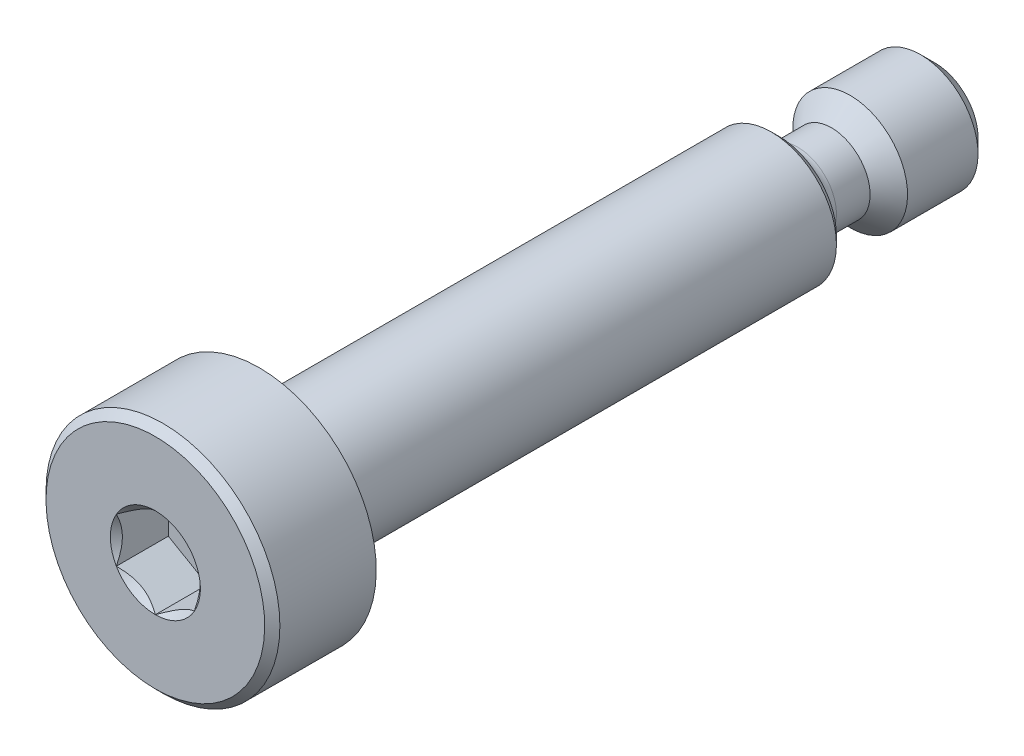
ISO-10303-21;
HEADER;
FILE_DESCRIPTION(('STEP AP214'),'2;1');
FILE_NAME('part.step','',(''),(''),'','','');
FILE_SCHEMA(('AUTOMOTIVE_DESIGN { 1 0 10303 214 1 1 1 1 }'));
ENDSEC;
DATA;
#1=APPLICATION_CONTEXT('core data for automotive mechanical design processes');
#2=APPLICATION_PROTOCOL_DEFINITION('international standard','automotive_design',2000,#1);
#3=PRODUCT_CONTEXT('',#1,'mechanical');
#4=PRODUCT('Part','Part','',(#3));
#5=PRODUCT_RELATED_PRODUCT_CATEGORY('part','',(#4));
#6=PRODUCT_DEFINITION_FORMATION('','',#4);
#7=PRODUCT_DEFINITION_CONTEXT('part definition',#1,'design');
#8=PRODUCT_DEFINITION('design','',#6,#7);
#9=PRODUCT_DEFINITION_SHAPE('','',#8);
#10=(LENGTH_UNIT() NAMED_UNIT(*) SI_UNIT(.MILLI.,.METRE.));
#11=(NAMED_UNIT(*) PLANE_ANGLE_UNIT() SI_UNIT($,.RADIAN.));
#12=(NAMED_UNIT(*) SI_UNIT($,.STERADIAN.) SOLID_ANGLE_UNIT());
#13=UNCERTAINTY_MEASURE_WITH_UNIT(LENGTH_MEASURE(1.E-05),#10,'distance_accuracy_value','');
#14=(GEOMETRIC_REPRESENTATION_CONTEXT(3) GLOBAL_UNCERTAINTY_ASSIGNED_CONTEXT((#13)) GLOBAL_UNIT_ASSIGNED_CONTEXT((#10,
#11,#12)) REPRESENTATION_CONTEXT('',''));
#15=CARTESIAN_POINT('',(0.,0.,0.));
#16=DIRECTION('',(0.,0.,1.));
#17=DIRECTION('',(1.,0.,0.));
#18=AXIS2_PLACEMENT_3D('',#15,#16,#17);
#19=CARTESIAN_POINT('',(0.,0.,0.));
#20=DIRECTION('',(0.,0.,1.));
#21=DIRECTION('',(0.,-1.,0.));
#22=AXIS2_PLACEMENT_3D('',#19,#20,#21);
#23=PLANE('',#22);
#24=CARTESIAN_POINT('',(0.,0.,0.));
#25=DIRECTION('',(0.,0.,1.));
#26=DIRECTION('',(1.,0.,0.));
#27=AXIS2_PLACEMENT_3D('',#24,#25,#26);
#28=CIRCLE('',#27,1.3748153285078);
#29=CARTESIAN_POINT('',(0.,-1.3748153285078,0.));
#30=VERTEX_POINT('',#29);
#31=CARTESIAN_POINT('',(1.190625,-0.6874076642539,0.));
#32=VERTEX_POINT('',#31);
#33=EDGE_CURVE('E62',#30,#32,#28,.T.);
#34=ORIENTED_EDGE('',*,*,#33,.F.);
#35=CARTESIAN_POINT('',(-1.190625,-0.687407664253898,0.));
#36=VERTEX_POINT('',#35);
#37=EDGE_CURVE('E69',#36,#30,#28,.T.);
#38=ORIENTED_EDGE('',*,*,#37,.F.);
#39=CARTESIAN_POINT('',(-1.190625,0.687407664253899,0.));
#40=VERTEX_POINT('',#39);
#41=EDGE_CURVE('E149',#40,#36,#28,.T.);
#42=ORIENTED_EDGE('',*,*,#41,.F.);
#43=CARTESIAN_POINT('',(0.,1.3748153285078,0.));
#44=VERTEX_POINT('',#43);
#45=EDGE_CURVE('E140',#44,#40,#28,.T.);
#46=ORIENTED_EDGE('',*,*,#45,.F.);
#47=CARTESIAN_POINT('',(1.190625,0.6874076642539,0.));
#48=VERTEX_POINT('',#47);
#49=EDGE_CURVE('E111',#48,#44,#28,.T.);
#50=ORIENTED_EDGE('',*,*,#49,.F.);
#51=EDGE_CURVE('E101',#32,#48,#28,.T.);
#52=ORIENTED_EDGE('',*,*,#51,.F.);
#53=EDGE_LOOP('',(#34,#38,#42,#46,#50,#52));
#54=FACE_BOUND('',#53,.T.);
#55=CARTESIAN_POINT('',(0.,0.,0.));
#56=DIRECTION('',(0.,0.,1.));
#57=DIRECTION('',(0.,-1.,0.));
#58=AXIS2_PLACEMENT_3D('',#55,#56,#57);
#59=CIRCLE('',#58,3.339703125);
#60=CARTESIAN_POINT('',(0.,-3.339703125,0.));
#61=VERTEX_POINT('',#60);
#62=EDGE_CURVE('E56',#61,#61,#59,.T.);
#63=ORIENTED_EDGE('',*,*,#62,.T.);
#64=EDGE_LOOP('',(#63));
#65=FACE_BOUND('',#64,.T.);
#66=ADVANCED_FACE('F41',(#54,#65),#23,.T.);
#67=CARTESIAN_POINT('',(0.,0.,-23.8125));
#68=DIRECTION('',(0.,0.,-1.));
#69=DIRECTION('',(0.,1.,0.));
#70=AXIS2_PLACEMENT_3D('',#67,#68,#69);
#71=CYLINDRICAL_SURFACE('',#70,3.571875);
#72=CARTESIAN_POINT('',(0.,0.,-0.232171874999996));
#73=DIRECTION('',(0.,0.,1.));
#74=DIRECTION('',(0.,-1.,0.));
#75=AXIS2_PLACEMENT_3D('',#72,#73,#74);
#76=CIRCLE('',#75,3.571875);
#77=CARTESIAN_POINT('',(0.,-3.571875,-0.232171874999996));
#78=VERTEX_POINT('',#77);
#79=EDGE_CURVE('E246',#78,#78,#76,.F.);
#80=ORIENTED_EDGE('',*,*,#79,.T.);
#81=EDGE_LOOP('',(#80));
#82=FACE_BOUND('',#81,.T.);
#83=CARTESIAN_POINT('',(0.,0.,-3.175));
#84=DIRECTION('',(0.,0.,-1.));
#85=DIRECTION('',(0.,1.,0.));
#86=AXIS2_PLACEMENT_3D('',#83,#84,#85);
#87=CIRCLE('',#86,3.571875);
#88=CARTESIAN_POINT('',(0.,3.571875,-3.175));
#89=VERTEX_POINT('',#88);
#90=EDGE_CURVE('E264',#89,#89,#87,.T.);
#91=ORIENTED_EDGE('',*,*,#90,.F.);
#92=EDGE_LOOP('',(#91));
#93=FACE_BOUND('',#92,.T.);
#94=ADVANCED_FACE('F211',(#82,#93),#71,.T.);
#95=CARTESIAN_POINT('',(0.,-3.571875,-3.175));
#96=DIRECTION('',(0.,0.,-1.));
#97=DIRECTION('',(0.,1.,0.));
#98=AXIS2_PLACEMENT_3D('',#95,#96,#97);
#99=PLANE('',#98);
#100=ORIENTED_EDGE('',*,*,#90,.T.);
#101=EDGE_LOOP('',(#100));
#102=FACE_BOUND('',#101,.T.);
#103=CARTESIAN_POINT('',(0.,0.,-3.175));
#104=DIRECTION('',(0.,0.,-1.));
#105=DIRECTION('',(0.,1.,0.));
#106=AXIS2_PLACEMENT_3D('',#103,#104,#105);
#107=CIRCLE('',#106,1.984375);
#108=CARTESIAN_POINT('',(0.,1.984375,-3.175));
#109=VERTEX_POINT('',#108);
#110=EDGE_CURVE('E267',#109,#109,#107,.T.);
#111=ORIENTED_EDGE('',*,*,#110,.F.);
#112=EDGE_LOOP('',(#111));
#113=FACE_BOUND('',#112,.T.);
#114=ADVANCED_FACE('F216',(#102,#113),#99,.T.);
#115=CARTESIAN_POINT('',(0.,0.,-23.8125));
#116=DIRECTION('',(0.,0.,-1.));
#117=DIRECTION('',(0.,1.,0.));
#118=AXIS2_PLACEMENT_3D('',#115,#116,#117);
#119=CYLINDRICAL_SURFACE('',#118,1.984375);
#120=CARTESIAN_POINT('',(0.,0.,-18.8178282229938));
#121=DIRECTION('',(0.,0.,1.));
#122=DIRECTION('',(0.,-1.,0.));
#123=AXIS2_PLACEMENT_3D('',#120,#121,#122);
#124=CIRCLE('',#123,1.984375);
#125=CARTESIAN_POINT('',(0.,-1.984375,-18.8178282229938));
#126=VERTEX_POINT('',#125);
#127=EDGE_CURVE('E235',#126,#126,#124,.T.);
#128=ORIENTED_EDGE('',*,*,#127,.T.);
#129=EDGE_LOOP('',(#128));
#130=FACE_BOUND('',#129,.T.);
#131=ORIENTED_EDGE('',*,*,#110,.T.);
#132=EDGE_LOOP('',(#131));
#133=FACE_BOUND('',#132,.T.);
#134=ADVANCED_FACE('F417',(#130,#133),#119,.T.);
#135=CARTESIAN_POINT('',(0.,0.,-19.6215));
#136=DIRECTION('',(0.,0.,-1.));
#137=DIRECTION('',(0.,1.,0.));
#138=AXIS2_PLACEMENT_3D('',#135,#136,#137);
#139=TOROIDAL_SURFACE('',#138,1.7526,0.571500000000003);
#140=CARTESIAN_POINT('',(0.,0.,-19.0500000676554));
#141=DIRECTION('',(0.,0.,-1.));
#142=DIRECTION('',(0.,1.,0.));
#143=AXIS2_PLACEMENT_3D('',#140,#141,#142);
#144=CIRCLE('',#143,1.75231777777677);
#145=CARTESIAN_POINT('',(0.,1.75231777777678,-19.0500000676554));
#146=VERTEX_POINT('',#145);
#147=EDGE_CURVE('E238',#146,#146,#144,.T.);
#148=ORIENTED_EDGE('',*,*,#147,.T.);
#149=EDGE_LOOP('',(#148));
#150=FACE_BOUND('',#149,.T.);
#151=CARTESIAN_POINT('',(0.,0.,-19.6215));
#152=DIRECTION('',(0.,0.,-1.));
#153=DIRECTION('',(0.,1.,0.));
#154=AXIS2_PLACEMENT_3D('',#151,#152,#153);
#155=CIRCLE('',#154,1.1811);
#156=CARTESIAN_POINT('',(0.,1.1811,-19.6215));
#157=VERTEX_POINT('',#156);
#158=EDGE_CURVE('E280',#157,#157,#155,.T.);
#159=ORIENTED_EDGE('',*,*,#158,.F.);
#160=EDGE_LOOP('',(#159));
#161=FACE_BOUND('',#160,.T.);
#162=ADVANCED_FACE('F406',(#150,#161),#139,.F.);
#163=CARTESIAN_POINT('',(0.,0.,-23.8125));
#164=DIRECTION('',(0.,0.,-1.));
#165=DIRECTION('',(0.,1.,0.));
#166=AXIS2_PLACEMENT_3D('',#163,#164,#165);
#167=CYLINDRICAL_SURFACE('',#166,1.1811);
#168=CARTESIAN_POINT('',(0.,0.,-20.6502));
#169=DIRECTION('',(0.,0.,-1.));
#170=DIRECTION('',(0.,1.,0.));
#171=AXIS2_PLACEMENT_3D('',#168,#169,#170);
#172=CIRCLE('',#171,1.1811);
#173=CARTESIAN_POINT('',(0.,1.1811,-20.6502));
#174=VERTEX_POINT('',#173);
#175=EDGE_CURVE('E286',#174,#174,#172,.T.);
#176=ORIENTED_EDGE('',*,*,#175,.F.);
#177=EDGE_LOOP('',(#176));
#178=FACE_BOUND('',#177,.T.);
#179=ORIENTED_EDGE('',*,*,#158,.T.);
#180=EDGE_LOOP('',(#179));
#181=FACE_BOUND('',#180,.T.);
#182=ADVANCED_FACE('F397',(#178,#181),#167,.T.);
#183=CARTESIAN_POINT('',(0.,0.,-20.6502));
#184=DIRECTION('',(0.,0.,-1.));
#185=DIRECTION('',(0.,1.,0.));
#186=AXIS2_PLACEMENT_3D('',#183,#184,#185);
#187=CONICAL_SURFACE('',#186,1.1811,0.785398163397445);
#188=CARTESIAN_POINT('',(0.,0.,-21.2217));
#189=DIRECTION('',(0.,0.,-1.));
#190=DIRECTION('',(0.,1.,0.));
#191=AXIS2_PLACEMENT_3D('',#188,#189,#190);
#192=CIRCLE('',#191,1.7526);
#193=CARTESIAN_POINT('',(0.,1.7526,-21.2217));
#194=VERTEX_POINT('',#193);
#195=EDGE_CURVE('E274',#194,#194,#192,.F.);
#196=ORIENTED_EDGE('',*,*,#195,.T.);
#197=EDGE_LOOP('',(#196));
#198=FACE_BOUND('',#197,.T.);
#199=ORIENTED_EDGE('',*,*,#175,.T.);
#200=EDGE_LOOP('',(#199));
#201=FACE_BOUND('',#200,.T.);
#202=ADVANCED_FACE('F387',(#198,#201),#187,.T.);
#203=CARTESIAN_POINT('',(0.,-1.7526,-23.8125));
#204=DIRECTION('',(0.,0.,-1.));
#205=DIRECTION('',(0.,1.,0.));
#206=AXIS2_PLACEMENT_3D('',#203,#204,#205);
#207=PLANE('',#206);
#208=CARTESIAN_POINT('',(0.,0.,-23.8125));
#209=DIRECTION('',(0.,0.,-1.));
#210=DIRECTION('',(0.,1.,0.));
#211=AXIS2_PLACEMENT_3D('',#208,#209,#210);
#212=CIRCLE('',#211,1.31445000000001);
#213=CARTESIAN_POINT('',(0.,1.31445000000001,-23.8125));
#214=VERTEX_POINT('',#213);
#215=EDGE_CURVE('E249',#214,#214,#212,.T.);
#216=ORIENTED_EDGE('',*,*,#215,.T.);
#217=EDGE_LOOP('',(#216));
#218=FACE_BOUND('',#217,.T.);
#219=ADVANCED_FACE('F377',(#218),#207,.T.);
#220=CARTESIAN_POINT('',(0.,0.,-23.8125));
#221=DIRECTION('',(0.,0.,-1.));
#222=DIRECTION('',(0.,1.,0.));
#223=AXIS2_PLACEMENT_3D('',#220,#221,#222);
#224=CYLINDRICAL_SURFACE('',#223,1.7526);
#225=CARTESIAN_POINT('',(0.,0.,-23.37435));
#226=DIRECTION('',(0.,0.,-1.));
#227=DIRECTION('',(0.,1.,0.));
#228=AXIS2_PLACEMENT_3D('',#225,#226,#227);
#229=CIRCLE('',#228,1.7526);
#230=CARTESIAN_POINT('',(0.,1.7526,-23.37435));
#231=VERTEX_POINT('',#230);
#232=EDGE_CURVE('E241',#231,#231,#229,.F.);
#233=ORIENTED_EDGE('',*,*,#232,.T.);
#234=EDGE_LOOP('',(#233));
#235=FACE_BOUND('',#234,.T.);
#236=ORIENTED_EDGE('',*,*,#195,.F.);
#237=EDGE_LOOP('',(#236));
#238=FACE_BOUND('',#237,.T.);
#239=ADVANCED_FACE('F224',(#235,#238),#224,.T.);
#240=CARTESIAN_POINT('',(0.,0.,-23.8125));
#241=DIRECTION('',(0.,0.,1.));
#242=DIRECTION('',(0.,-1.,0.));
#243=AXIS2_PLACEMENT_3D('',#240,#241,#242);
#244=CONICAL_SURFACE('',#243,1.31445000000001,0.785398163397447);
#245=ORIENTED_EDGE('',*,*,#232,.F.);
#246=EDGE_LOOP('',(#245));
#247=FACE_BOUND('',#246,.T.);
#248=ORIENTED_EDGE('',*,*,#215,.F.);
#249=EDGE_LOOP('',(#248));
#250=FACE_BOUND('',#249,.T.);
#251=ADVANCED_FACE('F221',(#247,#250),#244,.T.);
#252=CARTESIAN_POINT('',(0.,0.,-19.0500000696845));
#253=DIRECTION('',(0.,0.,1.));
#254=DIRECTION('',(0.,-1.,0.));
#255=AXIS2_PLACEMENT_3D('',#252,#253,#254);
#256=CONICAL_SURFACE('',#255,1.75231777777778,0.785151249807167);
#257=ORIENTED_EDGE('',*,*,#127,.F.);
#258=EDGE_LOOP('',(#257));
#259=FACE_BOUND('',#258,.T.);
#260=ORIENTED_EDGE('',*,*,#147,.F.);
#261=EDGE_LOOP('',(#260));
#262=FACE_BOUND('',#261,.T.);
#263=ADVANCED_FACE('F223',(#259,#262),#256,.T.);
#264=CARTESIAN_POINT('',(0.,0.,-0.232171874999996));
#265=DIRECTION('',(0.,0.,-1.));
#266=DIRECTION('',(0.,1.,0.));
#267=AXIS2_PLACEMENT_3D('',#264,#265,#266);
#268=CONICAL_SURFACE('',#267,3.571875,0.785398163397454);
#269=ORIENTED_EDGE('',*,*,#62,.F.);
#270=EDGE_LOOP('',(#269));
#271=FACE_BOUND('',#270,.T.);
#272=ORIENTED_EDGE('',*,*,#79,.F.);
#273=EDGE_LOOP('',(#272));
#274=FACE_BOUND('',#273,.T.);
#275=ADVANCED_FACE('F43',(#271,#274),#268,.T.);
#276=CARTESIAN_POINT('',(0.,0.,0.));
#277=DIRECTION('',(0.,0.,1.));
#278=DIRECTION('',(1.,0.,0.));
#279=AXIS2_PLACEMENT_3D('',#276,#277,#278);
#280=CONICAL_SURFACE('',#279,1.3748153285078,0.78539816339745);
#281=ORIENTED_EDGE('',*,*,#49,.T.);
#282=CARTESIAN_POINT('',(1.190825,0.687292194200061,0.000115484600024991));
#283=CARTESIAN_POINT('',(1.14989058041014,0.710925692369386,-0.0235012357857358));
#284=CARTESIAN_POINT('',(1.10827161169803,0.734954415158721,-0.0457312182768784));
#285=CARTESIAN_POINT('',(1.02340555632637,0.78395185507261,-0.086434337372562));
#286=CARTESIAN_POINT('',(0.98015039270904,0.808925235430916,-0.104884817352447));
#287=CARTESIAN_POINT('',(0.892928352542576,0.859282903800292,-0.136491161995678));
#288=CARTESIAN_POINT('',(0.848983705042075,0.884654357864149,-0.149726495756683));
#289=CARTESIAN_POINT('',(0.760126625836307,0.935956016463004,-0.170118548424604));
#290=CARTESIAN_POINT('',(0.715216911165245,0.96188465231757,-0.177290497104006));
#291=CARTESIAN_POINT('',(0.637820872343022,1.00656927616579,-0.183761461351143));
#292=CARTESIAN_POINT('',(0.605434587484354,1.025267506447,-0.184719679853209));
#293=CARTESIAN_POINT('',(0.540718926682231,1.06263111063189,-0.183107350927915));
#294=CARTESIAN_POINT('',(0.508389564872728,1.08129647637533,-0.18053602482042));
#295=CARTESIAN_POINT('',(0.444042843928516,1.11844707303394,-0.172013246006377));
#296=CARTESIAN_POINT('',(0.412025803663233,1.13693211984976,-0.166058645247435));
#297=CARTESIAN_POINT('',(0.348526236603543,1.17359361198509,-0.151090035928798));
#298=CARTESIAN_POINT('',(0.317043945355836,1.19176992131166,-0.142074714087944));
#299=CARTESIAN_POINT('',(0.236410161427874,1.23832385816825,-0.115317704161982));
#300=CARTESIAN_POINT('',(0.187767164732343,1.26640790540461,-0.0955631855639906));
#301=CARTESIAN_POINT('',(0.0923855836478818,1.32147648691945,-0.0510632310423188));
#302=CARTESIAN_POINT('',(0.0456413824128453,1.34846426408555,-0.0263340352838402));
#303=CARTESIAN_POINT('',(-0.000199999999999311,1.37493079856163,0.00011548460002513));
#304=B_SPLINE_CURVE_WITH_KNOTS('',3,(#282,#283,#284,#285,#286,#287,#288,#289,#290,#291,#292,
#293,#294,#295,#296,#297,#298,#299,#300,#301,#302,#303),.UNSPECIFIED.,.F.,.F.,(4,2,2,2,2,2,2,2,
2,2,4),(0.,0.15862567293412,0.318176079843271,0.475191357500655,0.631811068630748,
0.743878551794718,0.855970763007029,0.968167444423242,1.08041232768377,1.25873351645467,
1.43648174479847),.UNSPECIFIED.);
#305=EDGE_CURVE('E11',#48,#44,#304,.T.);
#306=ORIENTED_EDGE('',*,*,#305,.F.);
#307=EDGE_LOOP('',(#281,#306));
#308=FACE_BOUND('',#307,.T.);
#309=ADVANCED_FACE('F114',(#308),#280,.F.);
#310=ORIENTED_EDGE('',*,*,#45,.T.);
#311=CARTESIAN_POINT('',(0.000200000000000736,1.37493079856163,0.000115484600025078));
#312=CARTESIAN_POINT('',(-0.0407344195898556,1.35129730039231,-0.0235012357857357));
#313=CARTESIAN_POINT('',(-0.0823533883019731,1.32726857760297,-0.0457312182768784));
#314=CARTESIAN_POINT('',(-0.167219443673632,1.27827113768909,-0.0864343373725621));
#315=CARTESIAN_POINT('',(-0.21047460729096,1.25329775733078,-0.104884817352448));
#316=CARTESIAN_POINT('',(-0.297696647457424,1.2029400889614,-0.136491161995678));
#317=CARTESIAN_POINT('',(-0.341641294957925,1.17756863489755,-0.149726495756683));
#318=CARTESIAN_POINT('',(-0.430498374163693,1.12626697629869,-0.170118548424604));
#319=CARTESIAN_POINT('',(-0.475408088834755,1.10033834044413,-0.177290497104007));
#320=CARTESIAN_POINT('',(-0.552804127656978,1.0556537165959,-0.183761461351143));
#321=CARTESIAN_POINT('',(-0.585190412515647,1.0369554863147,-0.18471967985321));
#322=CARTESIAN_POINT('',(-0.64990607331777,0.99959188212981,-0.183107350927915));
#323=CARTESIAN_POINT('',(-0.682235435127273,0.980926516386364,-0.18053602482042));
#324=CARTESIAN_POINT('',(-0.746582156071485,0.943775919727754,-0.172013246006378));
#325=CARTESIAN_POINT('',(-0.778599196336768,0.925290872911937,-0.166058645247435));
#326=CARTESIAN_POINT('',(-0.842098763396457,0.888629380776601,-0.151090035928799));
#327=CARTESIAN_POINT('',(-0.873581054644164,0.870453071450031,-0.142074714087945));
#328=CARTESIAN_POINT('',(-0.954214838572127,0.823899134593444,-0.115317704161983));
#329=CARTESIAN_POINT('',(-1.00285783526766,0.795815087357089,-0.0955631855639911));
#330=CARTESIAN_POINT('',(-1.09823941635212,0.740746505842244,-0.0510632310423194));
#331=CARTESIAN_POINT('',(-1.14498361758715,0.713758728676141,-0.0263340352838409));
#332=CARTESIAN_POINT('',(-1.190825,0.687292194200061,0.000115484600024358));
#333=B_SPLINE_CURVE_WITH_KNOTS('',3,(#311,#312,#313,#314,#315,#316,#317,#318,#319,#320,#321,
#322,#323,#324,#325,#326,#327,#328,#329,#330,#331,#332),.UNSPECIFIED.,.F.,.F.,(4,2,2,2,2,2,2,2,
2,2,4),(0.,0.15862567293412,0.318176079843271,0.475191357500656,0.631811068630749,
0.743878551794719,0.85597076300703,0.968167444423243,1.08041232768377,1.25873351645467,
1.43648174479847),.UNSPECIFIED.);
#334=EDGE_CURVE('E142',#44,#40,#333,.T.);
#335=ORIENTED_EDGE('',*,*,#334,.F.);
#336=EDGE_LOOP('',(#310,#335));
#337=FACE_BOUND('',#336,.T.);
#338=ADVANCED_FACE('F342',(#337),#280,.F.);
#339=ORIENTED_EDGE('',*,*,#41,.T.);
#340=CARTESIAN_POINT('',(-1.190625,-1.3709714531464,0.440990447440543));
#341=CARTESIAN_POINT('',(-1.190625,-1.33758920657277,0.415789988952628));
#342=CARTESIAN_POINT('',(-1.190625,-1.30402095515484,0.390836620376461));
#343=CARTESIAN_POINT('',(-1.190625,-1.23643692315458,0.341526087304665));
#344=CARTESIAN_POINT('',(-1.190625,-1.20242103236242,0.317169074021072));
#345=CARTESIAN_POINT('',(-1.190625,-1.09909081497949,0.244798209093533));
#346=CARTESIAN_POINT('',(-1.190625,-1.02900143520981,0.197872622688341));
#347=CARTESIAN_POINT('',(-1.190625,-0.88202673754063,0.105752103394674));
#348=CARTESIAN_POINT('',(-1.190625,-0.804981866122375,0.0608088372989927));
#349=CARTESIAN_POINT('',(-1.190625,-0.647043893381155,-0.0214019754586499));
#350=CARTESIAN_POINT('',(-1.190625,-0.566164943760923,-0.0586953982437517));
#351=CARTESIAN_POINT('',(-1.190625,-0.444764933915431,-0.104320444420462));
#352=CARTESIAN_POINT('',(-1.190625,-0.406041211538074,-0.117415160961775));
#353=CARTESIAN_POINT('',(-1.190625,-0.327658904773021,-0.140495724086987));
#354=CARTESIAN_POINT('',(-1.190625,-0.288000256184282,-0.150481356498339));
#355=CARTESIAN_POINT('',(-1.190625,-0.208647693287848,-0.166658770921502));
#356=CARTESIAN_POINT('',(-1.190625,-0.168967240702489,-0.172915554139537));
#357=CARTESIAN_POINT('',(-1.190625,-0.0891819743864544,-0.1815131115746));
#358=CARTESIAN_POINT('',(-1.190625,-0.0490772347958503,-0.183854558946057));
#359=CARTESIAN_POINT('',(-1.190625,0.0297075772901231,-0.184447755934785));
#360=CARTESIAN_POINT('',(-1.190625,0.0683866067218447,-0.182844646209979));
#361=CARTESIAN_POINT('',(-1.190625,0.145416876518751,-0.175956972269255));
#362=CARTESIAN_POINT('',(-1.190625,0.183768052622755,-0.170671702349432));
#363=CARTESIAN_POINT('',(-1.190625,0.260508634780065,-0.156618587793747));
#364=CARTESIAN_POINT('',(-1.190625,0.298887051910833,-0.147791637425379));
#365=CARTESIAN_POINT('',(-1.190625,0.374805334115854,-0.127124290059815));
#366=CARTESIAN_POINT('',(-1.190625,0.412345269069194,-0.115284145209173));
#367=CARTESIAN_POINT('',(-1.190625,0.530535580740913,-0.0735526663999548));
#368=CARTESIAN_POINT('',(-1.190625,0.609503725551088,-0.0389086031730752));
#369=CARTESIAN_POINT('',(-1.190625,0.763730268871194,0.0381182518446584));
#370=CARTESIAN_POINT('',(-1.190625,0.838974064408866,0.0805288465159372));
#371=CARTESIAN_POINT('',(-1.190625,0.982775795881686,0.168025644829119));
#372=CARTESIAN_POINT('',(-1.190625,1.05148016574363,0.212874161838995));
#373=CARTESIAN_POINT('',(-1.190625,1.15270222220782,0.282205329675895));
#374=CARTESIAN_POINT('',(-1.190625,1.18600604109445,0.305560176080382));
#375=CARTESIAN_POINT('',(-1.190625,1.25215860324015,0.352887568742373));
#376=CARTESIAN_POINT('',(-1.190625,1.28500746829151,0.376859944571278));
#377=CARTESIAN_POINT('',(-1.190625,1.31766689387937,0.401088366474196));
#378=B_SPLINE_CURVE_WITH_KNOTS('',3,(#340,#341,#342,#343,#344,#345,#346,#347,#348,#349,#350,
#351,#352,#353,#354,#355,#356,#357,#358,#359,#360,#361,#362,#363,#364,#365,#366,#367,#368,#369,
#370,#371,#372,#373,#374,#375,#376,#377),.UNSPECIFIED.,.F.,.F.,(4,2,2,2,2,2,2,2,2,2,2,2,2,2,2,2,
2,2,4),(0.,0.125475644787213,0.25098278246174,0.503912518865619,0.771279184794251,
1.03772598276166,1.16025581663755,1.28279408924409,1.40312855519665,1.52344233020124,
1.63939577678759,1.75537145253145,1.87336894106198,1.99135655871207,2.24929724984114,
2.50818004702776,2.75419821455323,2.87622362097735,2.99821570364111),.UNSPECIFIED.);
#379=EDGE_CURVE('E147',#40,#36,#378,.F.);
#380=ORIENTED_EDGE('',*,*,#379,.F.);
#381=EDGE_LOOP('',(#339,#380));
#382=FACE_BOUND('',#381,.T.);
#383=ADVANCED_FACE('F339',(#382),#280,.F.);
#384=ORIENTED_EDGE('',*,*,#37,.T.);
#385=CARTESIAN_POINT('',(-1.190825,-0.68729219420006,0.000115484600024123));
#386=CARTESIAN_POINT('',(-1.14989058041014,-0.710925692369385,-0.0235012357857364));
#387=CARTESIAN_POINT('',(-1.10827161169803,-0.73495441515872,-0.0457312182768791));
#388=CARTESIAN_POINT('',(-1.02340555632637,-0.783951855072609,-0.0864343373725628));
#389=CARTESIAN_POINT('',(-0.980150392709039,-0.808925235430915,-0.104884817352448));
#390=CARTESIAN_POINT('',(-0.892928352542576,-0.859282903800291,-0.136491161995679));
#391=CARTESIAN_POINT('',(-0.848983705042075,-0.884654357864148,-0.149726495756684));
#392=CARTESIAN_POINT('',(-0.760126625836306,-0.935956016463003,-0.170118548424605));
#393=CARTESIAN_POINT('',(-0.715216911165245,-0.961884652317569,-0.177290497104007));
#394=CARTESIAN_POINT('',(-0.637820872343022,-1.00656927616579,-0.183761461351144));
#395=CARTESIAN_POINT('',(-0.605434587484353,-1.02526750644699,-0.18471967985321));
#396=CARTESIAN_POINT('',(-0.54071892668223,-1.06263111063189,-0.183107350927916));
#397=CARTESIAN_POINT('',(-0.508389564872727,-1.08129647637533,-0.180536024820421));
#398=CARTESIAN_POINT('',(-0.444042843928515,-1.11844707303394,-0.172013246006379));
#399=CARTESIAN_POINT('',(-0.412025803663232,-1.13693211984976,-0.166058645247436));
#400=CARTESIAN_POINT('',(-0.348526236603543,-1.17359361198509,-0.1510900359288));
#401=CARTESIAN_POINT('',(-0.317043945355836,-1.19176992131166,-0.142074714087946));
#402=CARTESIAN_POINT('',(-0.236410161427873,-1.23832385816825,-0.115317704161983));
#403=CARTESIAN_POINT('',(-0.187767164732342,-1.26640790540461,-0.0955631855639916));
#404=CARTESIAN_POINT('',(-0.0923855836478808,-1.32147648691945,-0.0510632310423197));
#405=CARTESIAN_POINT('',(-0.0456413824128441,-1.34846426408555,-0.026334035283841));
#406=CARTESIAN_POINT('',(0.000200000000000556,-1.37493079856163,0.000115484600024466));
#407=B_SPLINE_CURVE_WITH_KNOTS('',3,(#385,#386,#387,#388,#389,#390,#391,#392,#393,#394,#395,
#396,#397,#398,#399,#400,#401,#402,#403,#404,#405,#406),.UNSPECIFIED.,.F.,.F.,(4,2,2,2,2,2,2,2,
2,2,4),(0.,0.15862567293412,0.318176079843271,0.475191357500655,0.631811068630748,
0.743878551794718,0.855970763007029,0.968167444423242,1.08041232768377,1.25873351645467,
1.43648174479847),.UNSPECIFIED.);
#408=EDGE_CURVE('E175',#36,#30,#407,.T.);
#409=ORIENTED_EDGE('',*,*,#408,.F.);
#410=EDGE_LOOP('',(#384,#409));
#411=FACE_BOUND('',#410,.T.);
#412=ADVANCED_FACE('F348',(#411),#280,.F.);
#413=ORIENTED_EDGE('',*,*,#33,.T.);
#414=CARTESIAN_POINT('',(-0.000199999999999326,-1.37493079856163,0.000115484600024428));
#415=CARTESIAN_POINT('',(0.0407344195898571,-1.35129730039231,-0.0235012357857361));
#416=CARTESIAN_POINT('',(0.0823533883019745,-1.32726857760297,-0.0457312182768787));
#417=CARTESIAN_POINT('',(0.167219443673633,-1.27827113768909,-0.0864343373725625));
#418=CARTESIAN_POINT('',(0.210474607290961,-1.25329775733078,-0.104884817352448));
#419=CARTESIAN_POINT('',(0.297696647457425,-1.2029400889614,-0.136491161995678));
#420=CARTESIAN_POINT('',(0.341641294957926,-1.17756863489755,-0.149726495756683));
#421=CARTESIAN_POINT('',(0.430498374163694,-1.12626697629869,-0.170118548424604));
#422=CARTESIAN_POINT('',(0.475408088834755,-1.10033834044413,-0.177290497104007));
#423=CARTESIAN_POINT('',(0.552804127656979,-1.0556537165959,-0.183761461351143));
#424=CARTESIAN_POINT('',(0.585190412515647,-1.0369554863147,-0.18471967985321));
#425=CARTESIAN_POINT('',(0.64990607331777,-0.99959188212981,-0.183107350927915));
#426=CARTESIAN_POINT('',(0.682235435127273,-0.980926516386364,-0.18053602482042));
#427=CARTESIAN_POINT('',(0.746582156071485,-0.943775919727754,-0.172013246006378));
#428=CARTESIAN_POINT('',(0.778599196336768,-0.925290872911938,-0.166058645247435));
#429=CARTESIAN_POINT('',(0.842098763396458,-0.888629380776601,-0.151090035928799));
#430=CARTESIAN_POINT('',(0.873581054644165,-0.870453071450031,-0.142074714087945));
#431=CARTESIAN_POINT('',(0.954214838572127,-0.823899134593444,-0.115317704161982));
#432=CARTESIAN_POINT('',(1.00285783526766,-0.795815087357089,-0.0955631855639908));
#433=CARTESIAN_POINT('',(1.09823941635212,-0.740746505842244,-0.0510632310423191));
#434=CARTESIAN_POINT('',(1.14498361758716,-0.713758728676141,-0.0263340352838406));
#435=CARTESIAN_POINT('',(1.190825,-0.687292194200061,0.000115484600024877));
#436=B_SPLINE_CURVE_WITH_KNOTS('',3,(#414,#415,#416,#417,#418,#419,#420,#421,#422,#423,#424,
#425,#426,#427,#428,#429,#430,#431,#432,#433,#434,#435),.UNSPECIFIED.,.F.,.F.,(4,2,2,2,2,2,2,2,
2,2,4),(0.,0.15862567293412,0.318176079843271,0.475191357500655,0.631811068630748,
0.743878551794718,0.855970763007028,0.968167444423241,1.08041232768377,1.25873351645467,
1.43648174479847),.UNSPECIFIED.);
#437=EDGE_CURVE('E127',#30,#32,#436,.T.);
#438=ORIENTED_EDGE('',*,*,#437,.F.);
#439=EDGE_LOOP('',(#413,#438));
#440=FACE_BOUND('',#439,.T.);
#441=ADVANCED_FACE('F168',(#440),#280,.F.);
#442=ORIENTED_EDGE('',*,*,#51,.T.);
#443=CARTESIAN_POINT('',(1.190625,-1.37097145294694,0.440990447289942));
#444=CARTESIAN_POINT('',(1.190625,-1.3375892063789,0.415789988807828));
#445=CARTESIAN_POINT('',(1.190625,-1.30402095496658,0.390836620237452));
#446=CARTESIAN_POINT('',(1.190625,-1.23643692297761,0.341526087177205));
#447=CARTESIAN_POINT('',(1.190625,-1.20242103219112,0.31716907389937));
#448=CARTESIAN_POINT('',(1.190625,-1.09909081482554,0.244798208989215));
#449=CARTESIAN_POINT('',(1.190625,-1.02900143506767,0.197872622595563));
#450=CARTESIAN_POINT('',(1.190625,-0.882026737424229,0.105752103325633));
#451=CARTESIAN_POINT('',(1.190625,-0.80498186601998,0.0608088372420616));
#452=CARTESIAN_POINT('',(1.190625,-0.647043893307964,-0.0214019754931309));
#453=CARTESIAN_POINT('',(1.190625,-0.56616494370292,-0.0586953982678773));
#454=CARTESIAN_POINT('',(1.190625,-0.444764933868855,-0.104320444436902));
#455=CARTESIAN_POINT('',(1.190625,-0.406041211486713,-0.117415160978515));
#456=CARTESIAN_POINT('',(1.190625,-0.327658904711932,-0.140495724103358));
#457=CARTESIAN_POINT('',(1.190625,-0.288000256118251,-0.150481356514042));
#458=CARTESIAN_POINT('',(1.190625,-0.208647693212096,-0.166658770934747));
#459=CARTESIAN_POINT('',(1.190625,-0.168967240621961,-0.172915554151021));
#460=CARTESIAN_POINT('',(1.190625,-0.0891819742965329,-0.181513111581484));
#461=CARTESIAN_POINT('',(1.190625,-0.0490772347013121,-0.183854558950102));
#462=CARTESIAN_POINT('',(1.190625,0.0297075773931767,-0.184447755932346));
#463=CARTESIAN_POINT('',(1.190625,0.0683866068288089,-0.18284464620395));
#464=CARTESIAN_POINT('',(1.190625,0.145416876633151,-0.175956972255488));
#465=CARTESIAN_POINT('',(1.190625,0.183768052740679,-0.170671702331515));
#466=CARTESIAN_POINT('',(1.190625,0.260508634904944,-0.156618587767132));
#467=CARTESIAN_POINT('',(1.190625,0.298887052039132,-0.14779163739419));
#468=CARTESIAN_POINT('',(1.190625,0.374805334250663,-0.127124290019377));
#469=CARTESIAN_POINT('',(1.190625,0.412345269207094,-0.115284145164061));
#470=CARTESIAN_POINT('',(1.190625,0.530535580908839,-0.0735526663328059));
#471=CARTESIAN_POINT('',(1.190625,0.609503725744446,-0.038908603085652));
#472=CARTESIAN_POINT('',(1.190625,0.763730269113466,0.0381182519748639));
#473=CARTESIAN_POINT('',(1.190625,0.838974064674605,0.0805288466686665));
#474=CARTESIAN_POINT('',(1.190625,0.982775796189618,0.16802564502496));
#475=CARTESIAN_POINT('',(1.190625,1.05148016607044,0.212874162055227));
#476=CARTESIAN_POINT('',(1.190625,1.15270222256253,0.282205329922608));
#477=CARTESIAN_POINT('',(1.190625,1.18600604145834,0.305560176337174));
#478=CARTESIAN_POINT('',(1.190625,1.25215860362232,0.352887569019311));
#479=CARTESIAN_POINT('',(1.190625,1.28500746868279,0.376859944858283));
#480=CARTESIAN_POINT('',(1.190625,1.31766689427973,0.401088366771256));
#481=B_SPLINE_CURVE_WITH_KNOTS('',3,(#443,#444,#445,#446,#447,#448,#449,#450,#451,#452,#453,
#454,#455,#456,#457,#458,#459,#460,#461,#462,#463,#464,#465,#466,#467,#468,#469,#470,#471,#472,
#473,#474,#475,#476,#477,#478,#479,#480),.UNSPECIFIED.,.F.,.F.,(4,2,2,2,2,2,2,2,2,2,2,2,2,2,2,2,
2,2,4),(0.,0.125475644763329,0.250982782413967,0.503912518769174,0.771279184643225,
1.03772598255657,1.16025581644629,1.28279408906665,1.40312855503247,1.5234423300503,
1.63939577664877,1.75537145240478,1.87336894094838,1.99135655861152,2.24929724983449,
2.50818004711563,2.75419821472196,2.87622362118597,2.99821570388961),.UNSPECIFIED.);
#482=EDGE_CURVE('E105',#32,#48,#481,.T.);
#483=ORIENTED_EDGE('',*,*,#482,.F.);
#484=EDGE_LOOP('',(#442,#483));
#485=FACE_BOUND('',#484,.T.);
#486=ADVANCED_FACE('F103',(#485),#280,.F.);
#487=CARTESIAN_POINT('',(0.,0.,-1.5875));
#488=DIRECTION('',(0.,0.,1.));
#489=DIRECTION('',(1.,0.,0.));
#490=AXIS2_PLACEMENT_3D('',#487,#488,#489);
#491=PLANE('',#490);
#492=DIRECTION('',(0.,1.,0.));
#493=VECTOR('',#492,1.);
#494=CARTESIAN_POINT('',(1.190625,-0.687407664253899,-1.5875));
#495=LINE('',#494,#493);
#496=CARTESIAN_POINT('',(1.190625,-0.687407664253899,-1.5875));
#497=VERTEX_POINT('',#496);
#498=CARTESIAN_POINT('',(1.190625,0.687407664253899,-1.5875));
#499=VERTEX_POINT('',#498);
#500=EDGE_CURVE('E126',#497,#499,#495,.T.);
#501=ORIENTED_EDGE('',*,*,#500,.T.);
#502=DIRECTION('',(-0.866025403784438,0.5,0.));
#503=VECTOR('',#502,1.);
#504=CARTESIAN_POINT('',(1.190625,0.687407664253899,-1.5875));
#505=LINE('',#504,#503);
#506=CARTESIAN_POINT('',(0.,1.3748153285078,-1.5875));
#507=VERTEX_POINT('',#506);
#508=EDGE_CURVE('E131',#499,#507,#505,.T.);
#509=ORIENTED_EDGE('',*,*,#508,.T.);
#510=DIRECTION('',(-0.866025403784439,-0.5,0.));
#511=VECTOR('',#510,1.);
#512=CARTESIAN_POINT('',(0.,1.3748153285078,-1.5875));
#513=LINE('',#512,#511);
#514=CARTESIAN_POINT('',(-1.190625,0.687407664253899,-1.5875));
#515=VERTEX_POINT('',#514);
#516=EDGE_CURVE('E319',#507,#515,#513,.T.);
#517=ORIENTED_EDGE('',*,*,#516,.T.);
#518=DIRECTION('',(0.,-1.,0.));
#519=VECTOR('',#518,1.);
#520=CARTESIAN_POINT('',(-1.190625,0.687407664253899,-1.5875));
#521=LINE('',#520,#519);
#522=CARTESIAN_POINT('',(-1.190625,-0.687407664253898,-1.5875));
#523=VERTEX_POINT('',#522);
#524=EDGE_CURVE('E315',#515,#523,#521,.T.);
#525=ORIENTED_EDGE('',*,*,#524,.T.);
#526=DIRECTION('',(0.866025403784439,-0.5,0.));
#527=VECTOR('',#526,1.);
#528=CARTESIAN_POINT('',(-1.190625,-0.687407664253898,-1.5875));
#529=LINE('',#528,#527);
#530=CARTESIAN_POINT('',(0.,-1.3748153285078,-1.5875));
#531=VERTEX_POINT('',#530);
#532=EDGE_CURVE('E311',#523,#531,#529,.T.);
#533=ORIENTED_EDGE('',*,*,#532,.T.);
#534=DIRECTION('',(0.866025403784439,0.5,0.));
#535=VECTOR('',#534,1.);
#536=CARTESIAN_POINT('',(0.,-1.3748153285078,-1.5875));
#537=LINE('',#536,#535);
#538=EDGE_CURVE('E135',#531,#497,#537,.T.);
#539=ORIENTED_EDGE('',*,*,#538,.T.);
#540=EDGE_LOOP('',(#501,#509,#517,#525,#533,#539));
#541=FACE_BOUND('',#540,.T.);
#542=ADVANCED_FACE('F167',(#541),#491,.T.);
#543=CARTESIAN_POINT('',(1.190625,0.687407664253899,-1.5875));
#544=DIRECTION('',(0.5,0.866025403784438,0.));
#545=DIRECTION('',(-0.866025403784439,0.5,0.));
#546=AXIS2_PLACEMENT_3D('',#543,#544,#545);
#547=PLANE('',#546);
#548=DIRECTION('',(0.,0.,1.));
#549=VECTOR('',#548,1.);
#550=CARTESIAN_POINT('',(1.190625,0.687407664253899,-1.5875));
#551=LINE('',#550,#549);
#552=EDGE_CURVE('E122',#499,#48,#551,.T.);
#553=ORIENTED_EDGE('',*,*,#552,.T.);
#554=ORIENTED_EDGE('',*,*,#305,.T.);
#555=DIRECTION('',(0.,0.,1.));
#556=VECTOR('',#555,1.);
#557=CARTESIAN_POINT('',(0.,1.3748153285078,-1.5875));
#558=LINE('',#557,#556);
#559=EDGE_CURVE('E134',#507,#44,#558,.T.);
#560=ORIENTED_EDGE('',*,*,#559,.F.);
#561=ORIENTED_EDGE('',*,*,#508,.F.);
#562=EDGE_LOOP('',(#553,#554,#560,#561));
#563=FACE_BOUND('',#562,.T.);
#564=ADVANCED_FACE('F129',(#563),#547,.F.);
#565=CARTESIAN_POINT('',(0.,1.3748153285078,-1.5875));
#566=DIRECTION('',(-0.5,0.866025403784439,0.));
#567=DIRECTION('',(-0.866025403784439,-0.5,0.));
#568=AXIS2_PLACEMENT_3D('',#565,#566,#567);
#569=PLANE('',#568);
#570=ORIENTED_EDGE('',*,*,#559,.T.);
#571=ORIENTED_EDGE('',*,*,#334,.T.);
#572=DIRECTION('',(0.,0.,1.));
#573=VECTOR('',#572,1.);
#574=CARTESIAN_POINT('',(-1.190625,0.687407664253899,-1.5875));
#575=LINE('',#574,#573);
#576=EDGE_CURVE('E296',#515,#40,#575,.T.);
#577=ORIENTED_EDGE('',*,*,#576,.F.);
#578=ORIENTED_EDGE('',*,*,#516,.F.);
#579=EDGE_LOOP('',(#570,#571,#577,#578));
#580=FACE_BOUND('',#579,.T.);
#581=ADVANCED_FACE('F162',(#580),#569,.F.);
#582=CARTESIAN_POINT('',(-1.190625,0.687407664253899,-1.5875));
#583=DIRECTION('',(-1.,0.,0.));
#584=DIRECTION('',(0.,-1.,0.));
#585=AXIS2_PLACEMENT_3D('',#582,#583,#584);
#586=PLANE('',#585);
#587=ORIENTED_EDGE('',*,*,#576,.T.);
#588=ORIENTED_EDGE('',*,*,#379,.T.);
#589=DIRECTION('',(0.,0.,1.));
#590=VECTOR('',#589,1.);
#591=CARTESIAN_POINT('',(-1.190625,-0.687407664253898,-1.5875));
#592=LINE('',#591,#590);
#593=EDGE_CURVE('E299',#523,#36,#592,.T.);
#594=ORIENTED_EDGE('',*,*,#593,.F.);
#595=ORIENTED_EDGE('',*,*,#524,.F.);
#596=EDGE_LOOP('',(#587,#588,#594,#595));
#597=FACE_BOUND('',#596,.T.);
#598=ADVANCED_FACE('F200',(#597),#586,.F.);
#599=CARTESIAN_POINT('',(-1.190625,-0.687407664253898,-1.5875));
#600=DIRECTION('',(-0.5,-0.866025403784439,0.));
#601=DIRECTION('',(0.866025403784439,-0.5,0.));
#602=AXIS2_PLACEMENT_3D('',#599,#600,#601);
#603=PLANE('',#602);
#604=ORIENTED_EDGE('',*,*,#593,.T.);
#605=ORIENTED_EDGE('',*,*,#408,.T.);
#606=DIRECTION('',(0.,0.,1.));
#607=VECTOR('',#606,1.);
#608=CARTESIAN_POINT('',(0.,-1.3748153285078,-1.5875));
#609=LINE('',#608,#607);
#610=EDGE_CURVE('E302',#531,#30,#609,.T.);
#611=ORIENTED_EDGE('',*,*,#610,.F.);
#612=ORIENTED_EDGE('',*,*,#532,.F.);
#613=EDGE_LOOP('',(#604,#605,#611,#612));
#614=FACE_BOUND('',#613,.T.);
#615=ADVANCED_FACE('F196',(#614),#603,.F.);
#616=CARTESIAN_POINT('',(0.,-1.3748153285078,-1.5875));
#617=DIRECTION('',(0.5,-0.866025403784439,0.));
#618=DIRECTION('',(0.866025403784439,0.5,0.));
#619=AXIS2_PLACEMENT_3D('',#616,#617,#618);
#620=PLANE('',#619);
#621=ORIENTED_EDGE('',*,*,#610,.T.);
#622=ORIENTED_EDGE('',*,*,#437,.T.);
#623=DIRECTION('',(0.,0.,1.));
#624=VECTOR('',#623,1.);
#625=CARTESIAN_POINT('',(1.190625,-0.687407664253899,-1.5875));
#626=LINE('',#625,#624);
#627=EDGE_CURVE('E124',#497,#32,#626,.T.);
#628=ORIENTED_EDGE('',*,*,#627,.F.);
#629=ORIENTED_EDGE('',*,*,#538,.F.);
#630=EDGE_LOOP('',(#621,#622,#628,#629));
#631=FACE_BOUND('',#630,.T.);
#632=ADVANCED_FACE('F193',(#631),#620,.F.);
#633=CARTESIAN_POINT('',(1.190625,-0.687407664253899,-1.5875));
#634=DIRECTION('',(1.,0.,0.));
#635=DIRECTION('',(0.,0.,-1.));
#636=AXIS2_PLACEMENT_3D('',#633,#634,#635);
#637=PLANE('',#636);
#638=ORIENTED_EDGE('',*,*,#627,.T.);
#639=ORIENTED_EDGE('',*,*,#482,.T.);
#640=ORIENTED_EDGE('',*,*,#552,.F.);
#641=ORIENTED_EDGE('',*,*,#500,.F.);
#642=EDGE_LOOP('',(#638,#639,#640,#641));
#643=FACE_BOUND('',#642,.T.);
#644=ADVANCED_FACE('F120',(#643),#637,.F.);
#645=CLOSED_SHELL('',(#66,#94,#114,#134,#162,#182,#202,#219,#239,#251,#263,#275,#309,#338,#383,
#412,#441,#486,#542,#564,#581,#598,#615,#632,#644));
#646=MANIFOLD_SOLID_BREP('B2',#645);
#647=ADVANCED_BREP_SHAPE_REPRESENTATION('',(#18,#646),#14);
#648=SHAPE_DEFINITION_REPRESENTATION(#9,#647);
ENDSEC;
END-ISO-10303-21;
